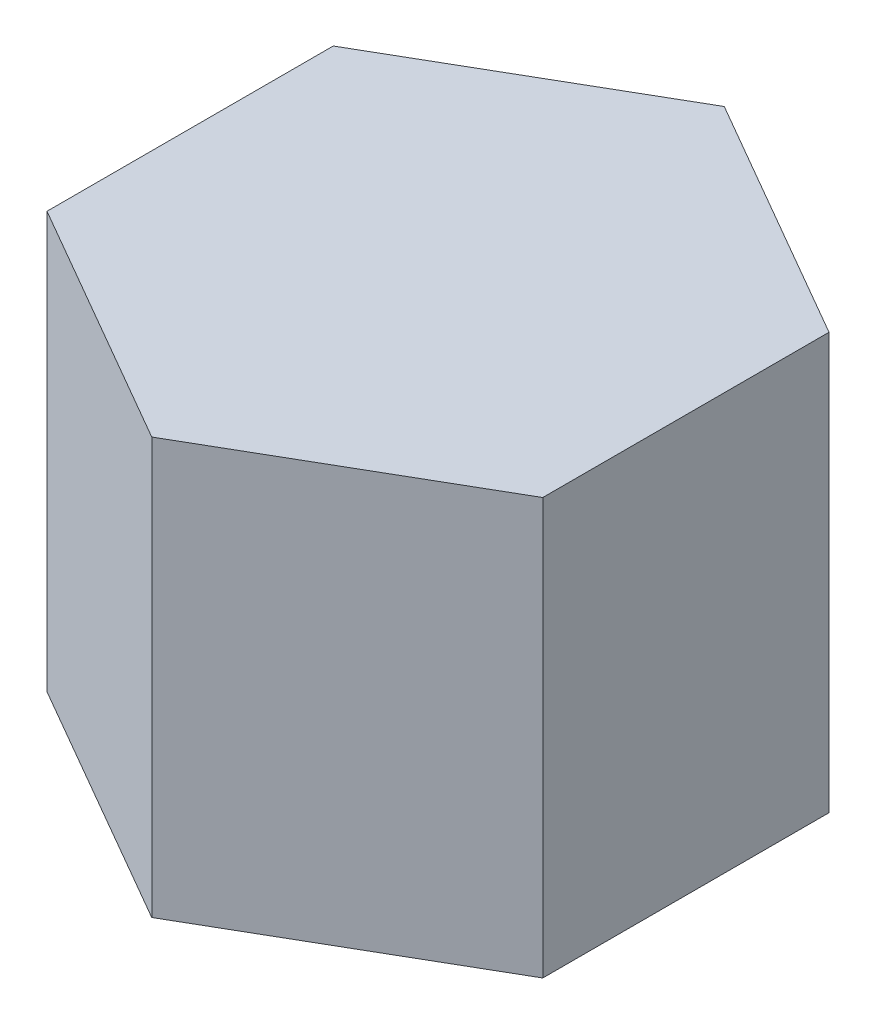
ISO-10303-21;
HEADER;
FILE_DESCRIPTION(('STEP AP214'),'2;1');
FILE_NAME('part.step','',(''),(''),'','','');
FILE_SCHEMA(('AUTOMOTIVE_DESIGN { 1 0 10303 214 1 1 1 1 }'));
ENDSEC;
DATA;
#1=APPLICATION_CONTEXT('core data for automotive mechanical design processes');
#2=APPLICATION_PROTOCOL_DEFINITION('international standard','automotive_design',2000,#1);
#3=PRODUCT_CONTEXT('',#1,'mechanical');
#4=PRODUCT('Part','Part','',(#3));
#5=PRODUCT_RELATED_PRODUCT_CATEGORY('part','',(#4));
#6=PRODUCT_DEFINITION_FORMATION('','',#4);
#7=PRODUCT_DEFINITION_CONTEXT('part definition',#1,'design');
#8=PRODUCT_DEFINITION('design','',#6,#7);
#9=PRODUCT_DEFINITION_SHAPE('','',#8);
#10=(LENGTH_UNIT() NAMED_UNIT(*) SI_UNIT(.MILLI.,.METRE.));
#11=(NAMED_UNIT(*) PLANE_ANGLE_UNIT() SI_UNIT($,.RADIAN.));
#12=(NAMED_UNIT(*) SI_UNIT($,.STERADIAN.) SOLID_ANGLE_UNIT());
#13=UNCERTAINTY_MEASURE_WITH_UNIT(LENGTH_MEASURE(1.E-05),#10,'distance_accuracy_value','');
#14=(GEOMETRIC_REPRESENTATION_CONTEXT(3) GLOBAL_UNCERTAINTY_ASSIGNED_CONTEXT((#13)) GLOBAL_UNIT_ASSIGNED_CONTEXT((#10,
#11,#12)) REPRESENTATION_CONTEXT('',''));
#15=CARTESIAN_POINT('',(0.,0.,0.));
#16=DIRECTION('',(0.,0.,1.));
#17=DIRECTION('',(1.,0.,0.));
#18=AXIS2_PLACEMENT_3D('',#15,#16,#17);
#19=CARTESIAN_POINT('',(206.839551417382,-147.556598747966,289.083895009141));
#20=DIRECTION('',(-0.499999999999943,0.,-0.866025403784471));
#21=DIRECTION('',(-0.866025403784471,0.,0.499999999999943));
#22=AXIS2_PLACEMENT_3D('',#19,#20,#21);
#23=PLANE('',#22);
#24=CARTESIAN_POINT('',(207.142660308706,-147.047793579175,288.908895009141));
#25=DIRECTION('',(-0.866025403784471,0.,0.499999999999943));
#26=VECTOR('',#25,1.);
#27=LINE('',#24,#26);
#28=CARTESIAN_POINT('',(207.142660308706,-147.047793579175,288.908895009141));
#29=VERTEX_POINT('',#28);
#30=CARTESIAN_POINT('',(206.839551417382,-147.047793579175,289.083895009141));
#31=VERTEX_POINT('',#30);
#32=EDGE_CURVE('E170',#29,#31,#27,.T.);
#33=ORIENTED_EDGE('',*,*,#32,.T.);
#34=CARTESIAN_POINT('',(206.839551417382,-147.556598747966,289.083895009141));
#35=DIRECTION('',(0.,1.,0.));
#36=VECTOR('',#35,1.);
#37=LINE('',#34,#36);
#38=CARTESIAN_POINT('',(206.839551417382,-147.556598747966,289.083895009141));
#39=VERTEX_POINT('',#38);
#40=EDGE_CURVE('E35',#39,#31,#37,.T.);
#41=ORIENTED_EDGE('',*,*,#40,.F.);
#42=CARTESIAN_POINT('',(207.142660308706,-147.556598747966,288.908895009141));
#43=DIRECTION('',(-0.866025403784471,0.,0.499999999999943));
#44=VECTOR('',#43,1.);
#45=LINE('',#42,#44);
#46=CARTESIAN_POINT('',(207.142660308706,-147.556598747966,288.908895009141));
#47=VERTEX_POINT('',#46);
#48=EDGE_CURVE('E159',#47,#39,#45,.T.);
#49=ORIENTED_EDGE('',*,*,#48,.F.);
#50=CARTESIAN_POINT('',(207.142660308706,-147.556598747966,288.908895009141));
#51=DIRECTION('',(0.,1.,0.));
#52=VECTOR('',#51,1.);
#53=LINE('',#50,#52);
#54=EDGE_CURVE('E10',#47,#29,#53,.T.);
#55=ORIENTED_EDGE('',*,*,#54,.T.);
#56=EDGE_LOOP('',(#33,#41,#49,#55));
#57=FACE_BOUND('',#56,.T.);
#58=ADVANCED_FACE('F16',(#57),#23,.F.);
#59=CARTESIAN_POINT('',(207.142660308706,-147.556598747966,291.594471220494));
#60=DIRECTION('',(-1.,0.,0.));
#61=DIRECTION('',(0.,-1.,0.));
#62=AXIS2_PLACEMENT_3D('',#59,#60,#61);
#63=PLANE('',#62);
#64=CARTESIAN_POINT('',(207.142660308706,-147.047793579175,288.558895009141));
#65=DIRECTION('',(0.,0.,1.));
#66=VECTOR('',#65,1.);
#67=LINE('',#64,#66);
#68=CARTESIAN_POINT('',(207.142660308706,-147.047793579175,288.558895009141));
#69=VERTEX_POINT('',#68);
#70=EDGE_CURVE('E167',#69,#29,#67,.T.);
#71=ORIENTED_EDGE('',*,*,#70,.T.);
#72=ORIENTED_EDGE('',*,*,#54,.F.);
#73=CARTESIAN_POINT('',(207.142660308706,-147.556598747966,288.558895009141));
#74=DIRECTION('',(0.,0.,1.));
#75=VECTOR('',#74,1.);
#76=LINE('',#73,#75);
#77=CARTESIAN_POINT('',(207.142660308706,-147.556598747966,288.558895009141));
#78=VERTEX_POINT('',#77);
#79=EDGE_CURVE('E156',#78,#47,#76,.T.);
#80=ORIENTED_EDGE('',*,*,#79,.F.);
#81=CARTESIAN_POINT('',(207.142660308706,-147.556598747966,288.558895009141));
#82=DIRECTION('',(0.,1.,0.));
#83=VECTOR('',#82,1.);
#84=LINE('',#81,#83);
#85=EDGE_CURVE('E27',#78,#69,#84,.T.);
#86=ORIENTED_EDGE('',*,*,#85,.T.);
#87=EDGE_LOOP('',(#71,#72,#80,#86));
#88=FACE_BOUND('',#87,.T.);
#89=ADVANCED_FACE('F189',(#88),#63,.F.);
#90=CARTESIAN_POINT('',(207.142660308706,-147.556598747966,288.558895009141));
#91=DIRECTION('',(-0.499999999999943,0.,0.866025403784471));
#92=DIRECTION('',(0.866025403784471,0.,0.499999999999943));
#93=AXIS2_PLACEMENT_3D('',#90,#91,#92);
#94=PLANE('',#93);
#95=CARTESIAN_POINT('',(206.839551417382,-147.047793579175,288.383895009141));
#96=DIRECTION('',(0.866025403784471,0.,0.499999999999943));
#97=VECTOR('',#96,1.);
#98=LINE('',#95,#97);
#99=CARTESIAN_POINT('',(206.839551417382,-147.047793579175,288.383895009141));
#100=VERTEX_POINT('',#99);
#101=EDGE_CURVE('E163',#100,#69,#98,.T.);
#102=ORIENTED_EDGE('',*,*,#101,.T.);
#103=ORIENTED_EDGE('',*,*,#85,.F.);
#104=CARTESIAN_POINT('',(206.839551417382,-147.556598747966,288.383895009141));
#105=DIRECTION('',(0.866025403784471,0.,0.499999999999943));
#106=VECTOR('',#105,1.);
#107=LINE('',#104,#106);
#108=CARTESIAN_POINT('',(206.839551417382,-147.556598747966,288.383895009141));
#109=VERTEX_POINT('',#108);
#110=EDGE_CURVE('E106',#109,#78,#107,.T.);
#111=ORIENTED_EDGE('',*,*,#110,.F.);
#112=CARTESIAN_POINT('',(206.839551417382,-147.556598747966,288.383895009141));
#113=DIRECTION('',(0.,1.,0.));
#114=VECTOR('',#113,1.);
#115=LINE('',#112,#114);
#116=EDGE_CURVE('E94',#109,#100,#115,.T.);
#117=ORIENTED_EDGE('',*,*,#116,.T.);
#118=EDGE_LOOP('',(#102,#103,#111,#117));
#119=FACE_BOUND('',#118,.T.);
#120=ADVANCED_FACE('F198',(#119),#94,.F.);
#121=CARTESIAN_POINT('',(206.839551417382,-147.556598747966,288.383895009141));
#122=DIRECTION('',(0.499999999999978,0.,0.866025403784452));
#123=DIRECTION('',(0.866025403784452,0.,-0.499999999999978));
#124=AXIS2_PLACEMENT_3D('',#121,#122,#123);
#125=PLANE('',#124);
#126=CARTESIAN_POINT('',(206.536442526057,-147.047793579175,288.558895009141));
#127=DIRECTION('',(0.866025403784452,0.,-0.499999999999978));
#128=VECTOR('',#127,1.);
#129=LINE('',#126,#128);
#130=CARTESIAN_POINT('',(206.536442526057,-147.047793579175,288.558895009141));
#131=VERTEX_POINT('',#130);
#132=EDGE_CURVE('E162',#131,#100,#129,.T.);
#133=ORIENTED_EDGE('',*,*,#132,.T.);
#134=ORIENTED_EDGE('',*,*,#116,.F.);
#135=CARTESIAN_POINT('',(206.536442526057,-147.556598747966,288.558895009141));
#136=DIRECTION('',(0.866025403784452,0.,-0.499999999999978));
#137=VECTOR('',#136,1.);
#138=LINE('',#135,#137);
#139=CARTESIAN_POINT('',(206.536442526057,-147.556598747966,288.558895009141));
#140=VERTEX_POINT('',#139);
#141=EDGE_CURVE('E98',#140,#109,#138,.T.);
#142=ORIENTED_EDGE('',*,*,#141,.F.);
#143=CARTESIAN_POINT('',(206.536442526057,-147.556598747966,288.558895009141));
#144=DIRECTION('',(0.,1.,0.));
#145=VECTOR('',#144,1.);
#146=LINE('',#143,#145);
#147=EDGE_CURVE('E79',#140,#131,#146,.T.);
#148=ORIENTED_EDGE('',*,*,#147,.T.);
#149=EDGE_LOOP('',(#133,#134,#142,#148));
#150=FACE_BOUND('',#149,.T.);
#151=ADVANCED_FACE('F100',(#150),#125,.F.);
#152=CARTESIAN_POINT('',(206.536442526057,-147.556598747966,291.594471220494));
#153=DIRECTION('',(1.,0.,0.));
#154=DIRECTION('',(0.,1.,0.));
#155=AXIS2_PLACEMENT_3D('',#152,#153,#154);
#156=PLANE('',#155);
#157=CARTESIAN_POINT('',(206.536442526057,-147.047793579175,288.908895009141));
#158=DIRECTION('',(0.,0.,-1.));
#159=VECTOR('',#158,1.);
#160=LINE('',#157,#159);
#161=CARTESIAN_POINT('',(206.536442526057,-147.047793579175,288.908895009141));
#162=VERTEX_POINT('',#161);
#163=EDGE_CURVE('E88',#162,#131,#160,.T.);
#164=ORIENTED_EDGE('',*,*,#163,.T.);
#165=ORIENTED_EDGE('',*,*,#147,.F.);
#166=CARTESIAN_POINT('',(206.536442526057,-147.556598747966,288.908895009141));
#167=DIRECTION('',(0.,0.,-1.));
#168=VECTOR('',#167,1.);
#169=LINE('',#166,#168);
#170=CARTESIAN_POINT('',(206.536442526057,-147.556598747966,288.908895009141));
#171=VERTEX_POINT('',#170);
#172=EDGE_CURVE('E84',#171,#140,#169,.T.);
#173=ORIENTED_EDGE('',*,*,#172,.F.);
#174=CARTESIAN_POINT('',(206.536442526057,-147.556598747966,288.908895009141));
#175=DIRECTION('',(0.,1.,0.));
#176=VECTOR('',#175,1.);
#177=LINE('',#174,#176);
#178=EDGE_CURVE('E58',#171,#162,#177,.T.);
#179=ORIENTED_EDGE('',*,*,#178,.T.);
#180=EDGE_LOOP('',(#164,#165,#173,#179));
#181=FACE_BOUND('',#180,.T.);
#182=ADVANCED_FACE('F82',(#181),#156,.F.);
#183=CARTESIAN_POINT('',(206.536442526057,-147.556598747966,288.908895009141));
#184=DIRECTION('',(0.499999999999978,0.,-0.866025403784452));
#185=DIRECTION('',(-0.866025403784452,0.,-0.499999999999978));
#186=AXIS2_PLACEMENT_3D('',#183,#184,#185);
#187=PLANE('',#186);
#188=CARTESIAN_POINT('',(206.839551417382,-147.047793579175,289.083895009141));
#189=DIRECTION('',(-0.866025403784452,0.,-0.499999999999978));
#190=VECTOR('',#189,1.);
#191=LINE('',#188,#190);
#192=EDGE_CURVE('E160',#31,#162,#191,.T.);
#193=ORIENTED_EDGE('',*,*,#192,.T.);
#194=ORIENTED_EDGE('',*,*,#178,.F.);
#195=CARTESIAN_POINT('',(206.839551417382,-147.556598747966,289.083895009141));
#196=DIRECTION('',(-0.866025403784452,0.,-0.499999999999978));
#197=VECTOR('',#196,1.);
#198=LINE('',#195,#197);
#199=EDGE_CURVE('E112',#39,#171,#198,.T.);
#200=ORIENTED_EDGE('',*,*,#199,.F.);
#201=ORIENTED_EDGE('',*,*,#40,.T.);
#202=EDGE_LOOP('',(#193,#194,#200,#201));
#203=FACE_BOUND('',#202,.T.);
#204=ADVANCED_FACE('F131',(#203),#187,.F.);
#205=CARTESIAN_POINT('',(206.491105863044,-147.556598747966,291.594471220494));
#206=DIRECTION('',(0.,1.,0.));
#207=DIRECTION('',(-1.,0.,0.));
#208=AXIS2_PLACEMENT_3D('',#205,#206,#207);
#209=PLANE('',#208);
#210=ORIENTED_EDGE('',*,*,#48,.T.);
#211=ORIENTED_EDGE('',*,*,#199,.T.);
#212=ORIENTED_EDGE('',*,*,#172,.T.);
#213=ORIENTED_EDGE('',*,*,#141,.T.);
#214=ORIENTED_EDGE('',*,*,#110,.T.);
#215=ORIENTED_EDGE('',*,*,#79,.T.);
#216=EDGE_LOOP('',(#210,#211,#212,#213,#214,#215));
#217=FACE_BOUND('',#216,.T.);
#218=ADVANCED_FACE('F111',(#217),#209,.F.);
#219=CARTESIAN_POINT('',(206.491105863044,-147.047793579175,291.594471220494));
#220=DIRECTION('',(0.,1.,0.));
#221=DIRECTION('',(-1.,0.,0.));
#222=AXIS2_PLACEMENT_3D('',#219,#220,#221);
#223=PLANE('',#222);
#224=ORIENTED_EDGE('',*,*,#32,.F.);
#225=ORIENTED_EDGE('',*,*,#70,.F.);
#226=ORIENTED_EDGE('',*,*,#101,.F.);
#227=ORIENTED_EDGE('',*,*,#132,.F.);
#228=ORIENTED_EDGE('',*,*,#163,.F.);
#229=ORIENTED_EDGE('',*,*,#192,.F.);
#230=EDGE_LOOP('',(#224,#225,#226,#227,#228,#229));
#231=FACE_BOUND('',#230,.T.);
#232=ADVANCED_FACE('F130',(#231),#223,.T.);
#233=CLOSED_SHELL('',(#58,#89,#120,#151,#182,#204,#218,#232));
#234=MANIFOLD_SOLID_BREP('B1',#233);
#235=ADVANCED_BREP_SHAPE_REPRESENTATION('',(#18,#234),#14);
#236=SHAPE_DEFINITION_REPRESENTATION(#9,#235);
ENDSEC;
END-ISO-10303-21;
